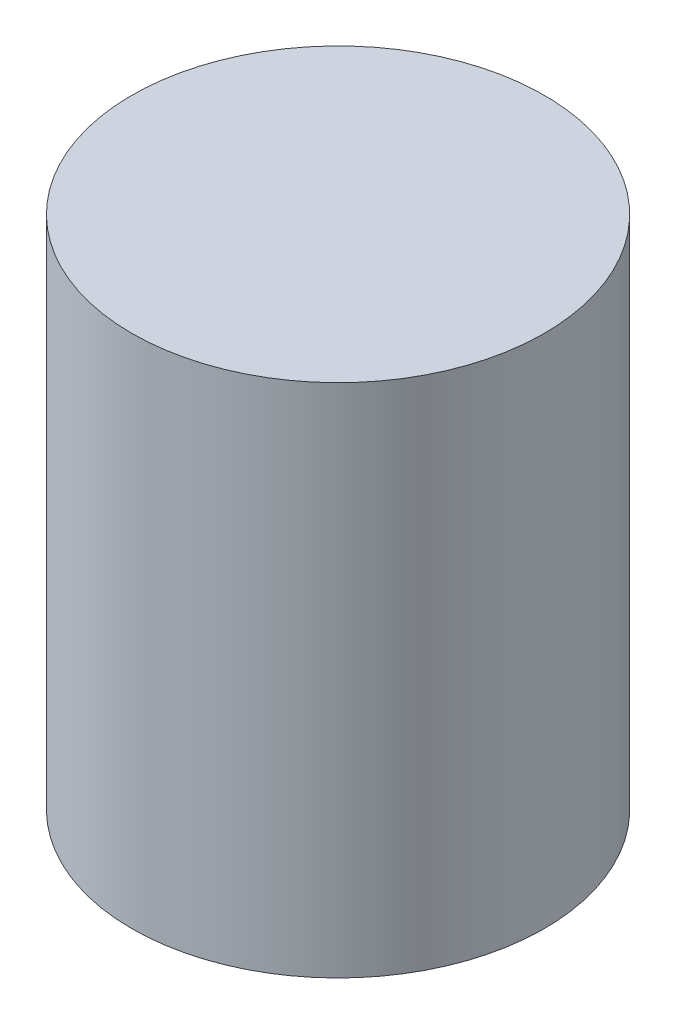
ISO-10303-21;
HEADER;
FILE_DESCRIPTION(('STEP AP214'),'2;1');
FILE_NAME('part.step','',(''),(''),'','','');
FILE_SCHEMA(('AUTOMOTIVE_DESIGN { 1 0 10303 214 1 1 1 1 }'));
ENDSEC;
DATA;
#1=APPLICATION_CONTEXT('core data for automotive mechanical design processes');
#2=APPLICATION_PROTOCOL_DEFINITION('international standard','automotive_design',2000,#1);
#3=PRODUCT_CONTEXT('',#1,'mechanical');
#4=PRODUCT('Part','Part','',(#3));
#5=PRODUCT_RELATED_PRODUCT_CATEGORY('part','',(#4));
#6=PRODUCT_DEFINITION_FORMATION('','',#4);
#7=PRODUCT_DEFINITION_CONTEXT('part definition',#1,'design');
#8=PRODUCT_DEFINITION('design','',#6,#7);
#9=PRODUCT_DEFINITION_SHAPE('','',#8);
#10=(LENGTH_UNIT() NAMED_UNIT(*) SI_UNIT(.MILLI.,.METRE.));
#11=(NAMED_UNIT(*) PLANE_ANGLE_UNIT() SI_UNIT($,.RADIAN.));
#12=(NAMED_UNIT(*) SI_UNIT($,.STERADIAN.) SOLID_ANGLE_UNIT());
#13=UNCERTAINTY_MEASURE_WITH_UNIT(LENGTH_MEASURE(1.E-05),#10,'distance_accuracy_value','');
#14=(GEOMETRIC_REPRESENTATION_CONTEXT(3) GLOBAL_UNCERTAINTY_ASSIGNED_CONTEXT((#13)) GLOBAL_UNIT_ASSIGNED_CONTEXT((#10,
#11,#12)) REPRESENTATION_CONTEXT('',''));
#15=CARTESIAN_POINT('',(0.,0.,0.));
#16=DIRECTION('',(0.,0.,1.));
#17=DIRECTION('',(1.,0.,0.));
#18=AXIS2_PLACEMENT_3D('',#15,#16,#17);
#19=CARTESIAN_POINT('',(0.,9.525,0.));
#20=DIRECTION('',(0.,-1.,0.));
#21=DIRECTION('',(0.,0.,-1.));
#22=AXIS2_PLACEMENT_3D('',#19,#20,#21);
#23=CYLINDRICAL_SURFACE('',#22,3.81);
#24=CARTESIAN_POINT('',(0.,9.525,0.));
#25=DIRECTION('',(0.,1.,0.));
#26=DIRECTION('',(0.,0.,1.));
#27=AXIS2_PLACEMENT_3D('',#24,#25,#26);
#28=CIRCLE('',#27,3.81);
#29=CARTESIAN_POINT('',(0.,9.525,3.81));
#30=VERTEX_POINT('',#29);
#31=EDGE_CURVE('E10',#30,#30,#28,.T.);
#32=ORIENTED_EDGE('',*,*,#31,.F.);
#33=EDGE_LOOP('',(#32));
#34=FACE_BOUND('',#33,.T.);
#35=CARTESIAN_POINT('',(0.,0.,0.));
#36=DIRECTION('',(0.,1.,0.));
#37=DIRECTION('',(0.,0.,1.));
#38=AXIS2_PLACEMENT_3D('',#35,#36,#37);
#39=CIRCLE('',#38,3.81);
#40=CARTESIAN_POINT('',(0.,0.,3.81));
#41=VERTEX_POINT('',#40);
#42=EDGE_CURVE('E36',#41,#41,#39,.T.);
#43=ORIENTED_EDGE('',*,*,#42,.T.);
#44=EDGE_LOOP('',(#43));
#45=FACE_BOUND('',#44,.T.);
#46=ADVANCED_FACE('F33',(#34,#45),#23,.T.);
#47=CARTESIAN_POINT('',(0.,9.525,0.));
#48=DIRECTION('',(0.,1.,0.));
#49=DIRECTION('',(0.,0.,1.));
#50=AXIS2_PLACEMENT_3D('',#47,#48,#49);
#51=PLANE('',#50);
#52=ORIENTED_EDGE('',*,*,#31,.T.);
#53=EDGE_LOOP('',(#52));
#54=FACE_BOUND('',#53,.T.);
#55=ADVANCED_FACE('F48',(#54),#51,.T.);
#56=CARTESIAN_POINT('',(0.,0.,0.));
#57=DIRECTION('',(0.,1.,0.));
#58=DIRECTION('',(0.,0.,1.));
#59=AXIS2_PLACEMENT_3D('',#56,#57,#58);
#60=PLANE('',#59);
#61=ORIENTED_EDGE('',*,*,#42,.F.);
#62=EDGE_LOOP('',(#61));
#63=FACE_BOUND('',#62,.T.);
#64=ADVANCED_FACE('F46',(#63),#60,.F.);
#65=CLOSED_SHELL('',(#46,#55,#64));
#66=MANIFOLD_SOLID_BREP('B2',#65);
#67=ADVANCED_BREP_SHAPE_REPRESENTATION('',(#18,#66),#14);
#68=SHAPE_DEFINITION_REPRESENTATION(#9,#67);
ENDSEC;
END-ISO-10303-21;
